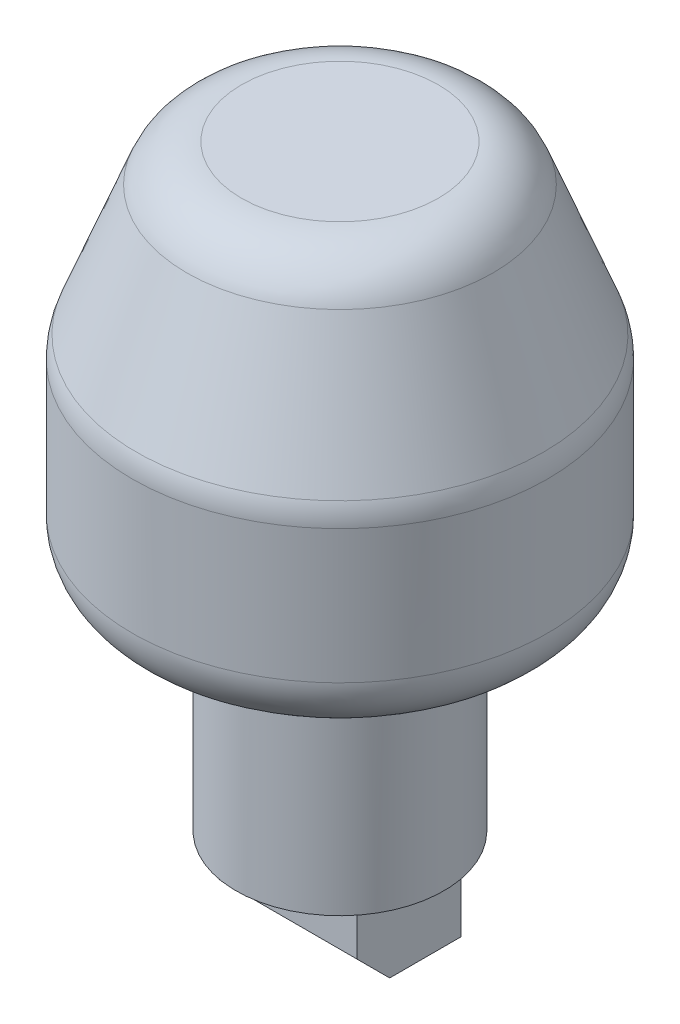
ISO-10303-21;
HEADER;
FILE_DESCRIPTION(('STEP AP214'),'2;1');
FILE_NAME('part.step','',(''),(''),'','','');
FILE_SCHEMA(('AUTOMOTIVE_DESIGN { 1 0 10303 214 1 1 1 1 }'));
ENDSEC;
DATA;
#1=APPLICATION_CONTEXT('core data for automotive mechanical design processes');
#2=APPLICATION_PROTOCOL_DEFINITION('international standard','automotive_design',2000,#1);
#3=PRODUCT_CONTEXT('',#1,'mechanical');
#4=PRODUCT('Part','Part','',(#3));
#5=PRODUCT_RELATED_PRODUCT_CATEGORY('part','',(#4));
#6=PRODUCT_DEFINITION_FORMATION('','',#4);
#7=PRODUCT_DEFINITION_CONTEXT('part definition',#1,'design');
#8=PRODUCT_DEFINITION('design','',#6,#7);
#9=PRODUCT_DEFINITION_SHAPE('','',#8);
#10=(LENGTH_UNIT() NAMED_UNIT(*) SI_UNIT(.MILLI.,.METRE.));
#11=(NAMED_UNIT(*) PLANE_ANGLE_UNIT() SI_UNIT($,.RADIAN.));
#12=(NAMED_UNIT(*) SI_UNIT($,.STERADIAN.) SOLID_ANGLE_UNIT());
#13=UNCERTAINTY_MEASURE_WITH_UNIT(LENGTH_MEASURE(1.E-05),#10,'distance_accuracy_value','');
#14=(GEOMETRIC_REPRESENTATION_CONTEXT(3) GLOBAL_UNCERTAINTY_ASSIGNED_CONTEXT((#13)) GLOBAL_UNIT_ASSIGNED_CONTEXT((#10,
#11,#12)) REPRESENTATION_CONTEXT('',''));
#15=CARTESIAN_POINT('',(0.,0.,0.));
#16=DIRECTION('',(0.,0.,1.));
#17=DIRECTION('',(1.,0.,0.));
#18=AXIS2_PLACEMENT_3D('',#15,#16,#17);
#19=CARTESIAN_POINT('',(7.4549,-9.01718142394338,0.));
#20=DIRECTION('',(0.,-1.,0.));
#21=DIRECTION('',(0.,0.,-1.));
#22=AXIS2_PLACEMENT_3D('',#19,#20,#21);
#23=PLANE('',#22);
#24=DIRECTION('',(0.,0.,1.));
#25=VECTOR('',#24,1.);
#26=CARTESIAN_POINT('',(7.3279,-9.01718142394338,0.));
#27=LINE('',#26,#25);
#28=CARTESIAN_POINT('',(7.3279,-9.01718142394338,-5.49919071197169));
#29=VERTEX_POINT('',#28);
#30=CARTESIAN_POINT('',(7.3279,-9.01718142394338,1.9430092880283));
#31=VERTEX_POINT('',#30);
#32=EDGE_CURVE('E61',#29,#31,#27,.T.);
#33=ORIENTED_EDGE('',*,*,#32,.F.);
#34=DIRECTION('',(1.,0.,0.));
#35=VECTOR('',#34,1.);
#36=CARTESIAN_POINT('',(0.,-9.01718142394338,-5.49919071197169));
#37=LINE('',#36,#35);
#38=CARTESIAN_POINT('',(2.54762,-9.01718142394338,-5.49919071197169));
#39=VERTEX_POINT('',#38);
#40=EDGE_CURVE('E212',#39,#29,#37,.T.);
#41=ORIENTED_EDGE('',*,*,#40,.F.);
#42=DIRECTION('',(0.,0.,-1.));
#43=VECTOR('',#42,1.);
#44=CARTESIAN_POINT('',(2.54762,-9.01718142394338,0.));
#45=LINE('',#44,#43);
#46=CARTESIAN_POINT('',(2.54762,-9.01718142394338,1.94300928802831));
#47=VERTEX_POINT('',#46);
#48=EDGE_CURVE('E227',#47,#39,#45,.T.);
#49=ORIENTED_EDGE('',*,*,#48,.F.);
#50=DIRECTION('',(-1.,0.,0.));
#51=VECTOR('',#50,1.);
#52=CARTESIAN_POINT('',(0.,-9.01718142394338,1.9430092880283));
#53=LINE('',#52,#51);
#54=EDGE_CURVE('E223',#31,#47,#53,.T.);
#55=ORIENTED_EDGE('',*,*,#54,.F.);
#56=EDGE_LOOP('',(#33,#41,#49,#55));
#57=FACE_BOUND('',#56,.T.);
#58=DIRECTION('',(-1.,0.,0.));
#59=VECTOR('',#58,1.);
#60=CARTESIAN_POINT('',(0.,-9.01718142394338,1.9430092880283));
#61=LINE('',#60,#59);
#62=CARTESIAN_POINT('',(-2.54762,-9.01718142394338,1.9430092880283));
#63=VERTEX_POINT('',#62);
#64=CARTESIAN_POINT('',(-7.3279,-9.01718142394338,1.9430092880283));
#65=VERTEX_POINT('',#64);
#66=EDGE_CURVE('E287',#63,#65,#61,.T.);
#67=ORIENTED_EDGE('',*,*,#66,.F.);
#68=DIRECTION('',(0.,0.,-1.));
#69=VECTOR('',#68,1.);
#70=CARTESIAN_POINT('',(-2.54762,-9.01718142394338,0.));
#71=LINE('',#70,#69);
#72=CARTESIAN_POINT('',(-2.54762,-9.01718142394338,-5.49919071197169));
#73=VERTEX_POINT('',#72);
#74=EDGE_CURVE('E265',#63,#73,#71,.T.);
#75=ORIENTED_EDGE('',*,*,#74,.T.);
#76=DIRECTION('',(1.,0.,0.));
#77=VECTOR('',#76,1.);
#78=CARTESIAN_POINT('',(0.,-9.01718142394338,-5.49919071197169));
#79=LINE('',#78,#77);
#80=CARTESIAN_POINT('',(-7.3279,-9.01718142394338,-5.49919071197169));
#81=VERTEX_POINT('',#80);
#82=EDGE_CURVE('E275',#81,#73,#79,.T.);
#83=ORIENTED_EDGE('',*,*,#82,.F.);
#84=DIRECTION('',(0.,0.,-1.));
#85=VECTOR('',#84,1.);
#86=CARTESIAN_POINT('',(-7.3279,-9.01718142394338,0.));
#87=LINE('',#86,#85);
#88=EDGE_CURVE('E290',#65,#81,#87,.T.);
#89=ORIENTED_EDGE('',*,*,#88,.F.);
#90=EDGE_LOOP('',(#67,#75,#83,#89));
#91=FACE_BOUND('',#90,.T.);
#92=DIRECTION('',(0.,0.,1.));
#93=VECTOR('',#92,1.);
#94=CARTESIAN_POINT('',(-7.4549,-9.01718142394338,0.));
#95=LINE('',#94,#93);
#96=CARTESIAN_POINT('',(-7.4549,-9.01718142394338,-5.6261907119717));
#97=VERTEX_POINT('',#96);
#98=CARTESIAN_POINT('',(-7.4549,-9.01718142394338,2.0700092880283));
#99=VERTEX_POINT('',#98);
#100=EDGE_CURVE('E325',#97,#99,#95,.T.);
#101=ORIENTED_EDGE('',*,*,#100,.F.);
#102=DIRECTION('',(-1.,0.,0.));
#103=VECTOR('',#102,1.);
#104=CARTESIAN_POINT('',(7.4549,-9.01718142394338,-5.6261907119717));
#105=LINE('',#104,#103);
#106=CARTESIAN_POINT('',(7.4549,-9.01718142394338,-5.6261907119717));
#107=VERTEX_POINT('',#106);
#108=EDGE_CURVE('E331',#107,#97,#105,.T.);
#109=ORIENTED_EDGE('',*,*,#108,.F.);
#110=DIRECTION('',(0.,0.,1.));
#111=VECTOR('',#110,1.);
#112=CARTESIAN_POINT('',(7.4549,-9.01718142394338,0.));
#113=LINE('',#112,#111);
#114=CARTESIAN_POINT('',(7.4549,-9.01718142394338,2.0700092880283));
#115=VERTEX_POINT('',#114);
#116=EDGE_CURVE('E311',#107,#115,#113,.T.);
#117=ORIENTED_EDGE('',*,*,#116,.T.);
#118=DIRECTION('',(-1.,0.,0.));
#119=VECTOR('',#118,1.);
#120=CARTESIAN_POINT('',(7.4549,-9.01718142394338,2.0700092880283));
#121=LINE('',#120,#119);
#122=EDGE_CURVE('E333',#115,#99,#121,.T.);
#123=ORIENTED_EDGE('',*,*,#122,.T.);
#124=EDGE_LOOP('',(#101,#109,#117,#123));
#125=FACE_BOUND('',#124,.T.);
#126=DIRECTION('',(-1.,0.,0.));
#127=VECTOR('',#126,1.);
#128=CARTESIAN_POINT('',(0.,-9.01718142394338,1.9430092880283));
#129=LINE('',#128,#127);
#130=CARTESIAN_POINT('',(2.42062,-9.01718142394338,1.9430092880283));
#131=VERTEX_POINT('',#130);
#132=CARTESIAN_POINT('',(-2.42062,-9.01718142394338,1.94300928802831));
#133=VERTEX_POINT('',#132);
#134=EDGE_CURVE('E255',#131,#133,#129,.T.);
#135=ORIENTED_EDGE('',*,*,#134,.F.);
#136=DIRECTION('',(0.,0.,-1.));
#137=VECTOR('',#136,1.);
#138=CARTESIAN_POINT('',(2.42062,-9.01718142394338,0.));
#139=LINE('',#138,#137);
#140=CARTESIAN_POINT('',(2.42062,-9.01718142394338,-5.49919071197169));
#141=VERTEX_POINT('',#140);
#142=EDGE_CURVE('E234',#131,#141,#139,.T.);
#143=ORIENTED_EDGE('',*,*,#142,.T.);
#144=DIRECTION('',(1.,0.,0.));
#145=VECTOR('',#144,1.);
#146=CARTESIAN_POINT('',(0.,-9.01718142394338,-5.49919071197169));
#147=LINE('',#146,#145);
#148=CARTESIAN_POINT('',(-2.42062,-9.01718142394338,-5.49919071197169));
#149=VERTEX_POINT('',#148);
#150=EDGE_CURVE('E243',#149,#141,#147,.T.);
#151=ORIENTED_EDGE('',*,*,#150,.F.);
#152=DIRECTION('',(0.,0.,-1.));
#153=VECTOR('',#152,1.);
#154=CARTESIAN_POINT('',(-2.42062,-9.01718142394338,0.));
#155=LINE('',#154,#153);
#156=EDGE_CURVE('E258',#133,#149,#155,.T.);
#157=ORIENTED_EDGE('',*,*,#156,.F.);
#158=EDGE_LOOP('',(#135,#143,#151,#157));
#159=FACE_BOUND('',#158,.T.);
#160=ADVANCED_FACE('F38',(#57,#91,#125,#159),#23,.T.);
#161=CARTESIAN_POINT('',(0.,0.,0.));
#162=DIRECTION('',(0.,1.,0.));
#163=DIRECTION('',(-1.,0.,0.));
#164=AXIS2_PLACEMENT_3D('',#161,#162,#163);
#165=PLANE('',#164);
#166=DIRECTION('',(-1.,0.,0.));
#167=VECTOR('',#166,1.);
#168=CARTESIAN_POINT('',(7.4549,0.,5.62619071197169));
#169=LINE('',#168,#167);
#170=CARTESIAN_POINT('',(7.4549,0.,5.62619071197169));
#171=VERTEX_POINT('',#170);
#172=CARTESIAN_POINT('',(-7.4549,0.,5.62619071197169));
#173=VERTEX_POINT('',#172);
#174=EDGE_CURVE('E338',#171,#173,#169,.T.);
#175=ORIENTED_EDGE('',*,*,#174,.F.);
#176=DIRECTION('',(0.,0.,-1.));
#177=VECTOR('',#176,1.);
#178=CARTESIAN_POINT('',(7.4549,0.,0.));
#179=LINE('',#178,#177);
#180=CARTESIAN_POINT('',(7.4549,0.,-5.62619071197169));
#181=VERTEX_POINT('',#180);
#182=EDGE_CURVE('E304',#171,#181,#179,.T.);
#183=ORIENTED_EDGE('',*,*,#182,.T.);
#184=DIRECTION('',(-1.,0.,0.));
#185=VECTOR('',#184,1.);
#186=CARTESIAN_POINT('',(7.4549,0.,-5.62619071197169));
#187=LINE('',#186,#185);
#188=CARTESIAN_POINT('',(-7.4549,0.,-5.62619071197169));
#189=VERTEX_POINT('',#188);
#190=EDGE_CURVE('E317',#181,#189,#187,.T.);
#191=ORIENTED_EDGE('',*,*,#190,.T.);
#192=DIRECTION('',(0.,0.,-1.));
#193=VECTOR('',#192,1.);
#194=CARTESIAN_POINT('',(-7.4549,0.,0.));
#195=LINE('',#194,#193);
#196=EDGE_CURVE('E297',#173,#189,#195,.T.);
#197=ORIENTED_EDGE('',*,*,#196,.F.);
#198=EDGE_LOOP('',(#175,#183,#191,#197));
#199=FACE_BOUND('',#198,.T.);
#200=CARTESIAN_POINT('',(0.,0.,0.));
#201=DIRECTION('',(0.,1.,0.));
#202=DIRECTION('',(-1.,0.,0.));
#203=AXIS2_PLACEMENT_3D('',#200,#201,#202);
#204=CIRCLE('',#203,11.2395);
#205=CARTESIAN_POINT('',(-11.2395,0.,0.));
#206=VERTEX_POINT('',#205);
#207=EDGE_CURVE('E343',#206,#206,#204,.T.);
#208=ORIENTED_EDGE('',*,*,#207,.F.);
#209=EDGE_LOOP('',(#208));
#210=FACE_BOUND('',#209,.T.);
#211=ADVANCED_FACE('F378',(#199,#210),#165,.F.);
#212=CARTESIAN_POINT('',(0.,64.6193127521161,0.));
#213=DIRECTION('',(0.,1.,0.));
#214=DIRECTION('',(-1.,0.,0.));
#215=AXIS2_PLACEMENT_3D('',#212,#213,#214);
#216=CYLINDRICAL_SURFACE('',#215,11.2395);
#217=CARTESIAN_POINT('',(0.,21.2344,0.));
#218=DIRECTION('',(0.,-1.,0.));
#219=DIRECTION('',(0.,0.,-1.));
#220=AXIS2_PLACEMENT_3D('',#217,#218,#219);
#221=CIRCLE('',#220,11.2395);
#222=CARTESIAN_POINT('',(-1.778,21.2344,11.0979762231679));
#223=VERTEX_POINT('',#222);
#224=CARTESIAN_POINT('',(1.778,21.2344,11.0979762231679));
#225=VERTEX_POINT('',#224);
#226=EDGE_CURVE('E185',#223,#225,#221,.F.);
#227=ORIENTED_EDGE('',*,*,#226,.F.);
#228=DIRECTION('',(0.,1.,0.));
#229=VECTOR('',#228,1.);
#230=CARTESIAN_POINT('',(-1.778,64.6193127521161,11.0979762231679));
#231=LINE('',#230,#229);
#232=CARTESIAN_POINT('',(-1.778,23.4188,11.0979762231679));
#233=VERTEX_POINT('',#232);
#234=EDGE_CURVE('E190',#233,#223,#231,.F.);
#235=ORIENTED_EDGE('',*,*,#234,.F.);
#236=CARTESIAN_POINT('',(0.,23.4188,0.));
#237=DIRECTION('',(0.,1.,0.));
#238=DIRECTION('',(-1.,0.,0.));
#239=AXIS2_PLACEMENT_3D('',#236,#237,#238);
#240=CIRCLE('',#239,11.2395);
#241=CARTESIAN_POINT('',(1.778,23.4188,11.0979762231679));
#242=VERTEX_POINT('',#241);
#243=EDGE_CURVE('E341',#242,#233,#240,.T.);
#244=ORIENTED_EDGE('',*,*,#243,.F.);
#245=DIRECTION('',(0.,1.,0.));
#246=VECTOR('',#245,1.);
#247=CARTESIAN_POINT('',(1.778,64.6193127521161,11.0979762231679));
#248=LINE('',#247,#246);
#249=EDGE_CURVE('E53',#225,#242,#248,.T.);
#250=ORIENTED_EDGE('',*,*,#249,.F.);
#251=EDGE_LOOP('',(#227,#235,#244,#250));
#252=FACE_BOUND('',#251,.T.);
#253=ORIENTED_EDGE('',*,*,#207,.T.);
#254=EDGE_LOOP('',(#253));
#255=FACE_BOUND('',#254,.T.);
#256=ADVANCED_FACE('F200',(#252,#255),#216,.T.);
#257=CARTESIAN_POINT('',(11.2395,23.4188,0.));
#258=DIRECTION('',(0.,1.,0.));
#259=DIRECTION('',(-1.,0.,0.));
#260=AXIS2_PLACEMENT_3D('',#257,#258,#259);
#261=PLANE('',#260);
#262=CARTESIAN_POINT('',(0.,23.4188,0.));
#263=DIRECTION('',(0.,1.,0.));
#264=DIRECTION('',(-1.,0.,0.));
#265=AXIS2_PLACEMENT_3D('',#262,#263,#264);
#266=CIRCLE('',#265,16.123370687632);
#267=CARTESIAN_POINT('',(-16.123370687632,23.4188,0.));
#268=VERTEX_POINT('',#267);
#269=EDGE_CURVE('E352',#268,#268,#266,.F.);
#270=ORIENTED_EDGE('',*,*,#269,.T.);
#271=EDGE_LOOP('',(#270));
#272=FACE_BOUND('',#271,.T.);
#273=ORIENTED_EDGE('',*,*,#243,.T.);
#274=DIRECTION('',(0.,0.,1.));
#275=VECTOR('',#274,1.);
#276=CARTESIAN_POINT('',(-1.778,23.4188,-22.474370687632));
#277=LINE('',#276,#275);
#278=CARTESIAN_POINT('',(-1.778,23.4188,14.29512));
#279=VERTEX_POINT('',#278);
#280=EDGE_CURVE('E195',#233,#279,#277,.T.);
#281=ORIENTED_EDGE('',*,*,#280,.T.);
#282=DIRECTION('',(-1.,0.,0.));
#283=VECTOR('',#282,1.);
#284=CARTESIAN_POINT('',(-1.778,23.4188,14.29512));
#285=LINE('',#284,#283);
#286=CARTESIAN_POINT('',(1.778,23.4188,14.29512));
#287=VERTEX_POINT('',#286);
#288=EDGE_CURVE('E708',#287,#279,#285,.T.);
#289=ORIENTED_EDGE('',*,*,#288,.F.);
#290=DIRECTION('',(0.,0.,1.));
#291=VECTOR('',#290,1.);
#292=CARTESIAN_POINT('',(1.778,23.4188,-22.474370687632));
#293=LINE('',#292,#291);
#294=EDGE_CURVE('E224',#242,#287,#293,.T.);
#295=ORIENTED_EDGE('',*,*,#294,.F.);
#296=EDGE_LOOP('',(#273,#281,#289,#295));
#297=FACE_BOUND('',#296,.T.);
#298=ADVANCED_FACE('F406',(#272,#297),#261,.F.);
#299=CARTESIAN_POINT('',(0.,64.6193127521161,0.));
#300=DIRECTION('',(0.,1.,0.));
#301=DIRECTION('',(-1.,0.,0.));
#302=AXIS2_PLACEMENT_3D('',#299,#300,#301);
#303=CYLINDRICAL_SURFACE('',#302,22.473370687632);
#304=CARTESIAN_POINT('',(0.,29.7688,0.));
#305=DIRECTION('',(0.,1.,0.));
#306=DIRECTION('',(-1.,0.,0.));
#307=AXIS2_PLACEMENT_3D('',#304,#305,#306);
#308=CIRCLE('',#307,22.473370687632);
#309=CARTESIAN_POINT('',(-22.473370687632,29.7688,0.));
#310=VERTEX_POINT('',#309);
#311=EDGE_CURVE('E349',#310,#310,#308,.T.);
#312=ORIENTED_EDGE('',*,*,#311,.T.);
#313=EDGE_LOOP('',(#312));
#314=FACE_BOUND('',#313,.T.);
#315=CARTESIAN_POINT('',(0.,44.2210933640308,0.));
#316=DIRECTION('',(0.,-1.,0.));
#317=DIRECTION('',(1.,0.,0.));
#318=AXIS2_PLACEMENT_3D('',#315,#316,#317);
#319=CIRCLE('',#318,22.473370687632);
#320=CARTESIAN_POINT('',(22.473370687632,44.2210933640308,0.));
#321=VERTEX_POINT('',#320);
#322=EDGE_CURVE('E346',#321,#321,#319,.T.);
#323=ORIENTED_EDGE('',*,*,#322,.T.);
#324=EDGE_LOOP('',(#323));
#325=FACE_BOUND('',#324,.T.);
#326=ADVANCED_FACE('F403',(#314,#325),#303,.T.);
#327=CARTESIAN_POINT('',(0.,45.4152,0.));
#328=DIRECTION('',(0.,-1.,0.));
#329=DIRECTION('',(1.,0.,0.));
#330=AXIS2_PLACEMENT_3D('',#327,#328,#329);
#331=CONICAL_SURFACE('',#330,22.473370687632,0.371755130674789);
#332=CARTESIAN_POINT('',(0.,46.5277386775342,0.));
#333=DIRECTION('',(0.,1.,0.));
#334=DIRECTION('',(-1.,0.,0.));
#335=AXIS2_PLACEMENT_3D('',#332,#333,#334);
#336=CIRCLE('',#335,22.0396099828003);
#337=CARTESIAN_POINT('',(-22.0396099828003,46.5277386775342,0.));
#338=VERTEX_POINT('',#337);
#339=EDGE_CURVE('E46',#338,#338,#336,.T.);
#340=ORIENTED_EDGE('',*,*,#339,.T.);
#341=EDGE_LOOP('',(#340));
#342=FACE_BOUND('',#341,.T.);
#343=CARTESIAN_POINT('',(0.,60.5759580656195,0.));
#344=DIRECTION('',(0.,1.,0.));
#345=DIRECTION('',(-1.,0.,0.));
#346=AXIS2_PLACEMENT_3D('',#343,#344,#345);
#347=CIRCLE('',#346,16.5624381177172);
#348=CARTESIAN_POINT('',(-16.5624381177172,60.5759580656195,0.));
#349=VERTEX_POINT('',#348);
#350=EDGE_CURVE('E355',#349,#349,#347,.F.);
#351=ORIENTED_EDGE('',*,*,#350,.T.);
#352=EDGE_LOOP('',(#351));
#353=FACE_BOUND('',#352,.T.);
#354=ADVANCED_FACE('F360',(#342,#353),#331,.T.);
#355=CARTESIAN_POINT('',(14.986,64.6193127521161,0.));
#356=DIRECTION('',(0.,-1.,0.));
#357=DIRECTION('',(1.,0.,0.));
#358=AXIS2_PLACEMENT_3D('',#355,#356,#357);
#359=PLANE('',#358);
#360=CARTESIAN_POINT('',(0.,64.6193127521161,0.));
#361=DIRECTION('',(0.,-1.,0.));
#362=DIRECTION('',(1.,0.,0.));
#363=AXIS2_PLACEMENT_3D('',#360,#361,#362);
#364=CIRCLE('',#363,10.6461988225489);
#365=CARTESIAN_POINT('',(10.6461988225489,64.6193127521161,0.));
#366=VERTEX_POINT('',#365);
#367=EDGE_CURVE('E11',#366,#366,#364,.F.);
#368=ORIENTED_EDGE('',*,*,#367,.T.);
#369=EDGE_LOOP('',(#368));
#370=FACE_BOUND('',#369,.T.);
#371=ADVANCED_FACE('F373',(#370),#359,.F.);
#372=CARTESIAN_POINT('',(0.,29.7688,0.));
#373=DIRECTION('',(0.,1.,0.));
#374=DIRECTION('',(-1.,0.,0.));
#375=AXIS2_PLACEMENT_3D('',#372,#373,#374);
#376=TOROIDAL_SURFACE('',#375,16.123370687632,6.35);
#377=ORIENTED_EDGE('',*,*,#269,.F.);
#378=EDGE_LOOP('',(#377));
#379=FACE_BOUND('',#378,.T.);
#380=ORIENTED_EDGE('',*,*,#311,.F.);
#381=EDGE_LOOP('',(#380));
#382=FACE_BOUND('',#381,.T.);
#383=ADVANCED_FACE('F365',(#379,#382),#376,.T.);
#384=CARTESIAN_POINT('',(0.,44.2210933640308,0.));
#385=DIRECTION('',(0.,-1.,0.));
#386=DIRECTION('',(1.,0.,0.));
#387=AXIS2_PLACEMENT_3D('',#384,#385,#386);
#388=TOROIDAL_SURFACE('',#387,16.123370687632,6.35);
#389=ORIENTED_EDGE('',*,*,#322,.F.);
#390=EDGE_LOOP('',(#389));
#391=FACE_BOUND('',#390,.T.);
#392=ORIENTED_EDGE('',*,*,#339,.F.);
#393=EDGE_LOOP('',(#392));
#394=FACE_BOUND('',#393,.T.);
#395=ADVANCED_FACE('F363',(#391,#394),#388,.T.);
#396=CARTESIAN_POINT('',(0.,58.2693127521161,0.));
#397=DIRECTION('',(0.,-1.,0.));
#398=DIRECTION('',(1.,0.,0.));
#399=AXIS2_PLACEMENT_3D('',#396,#397,#398);
#400=TOROIDAL_SURFACE('',#399,10.6461988225489,6.35);
#401=ORIENTED_EDGE('',*,*,#350,.F.);
#402=EDGE_LOOP('',(#401));
#403=FACE_BOUND('',#402,.T.);
#404=ORIENTED_EDGE('',*,*,#367,.F.);
#405=EDGE_LOOP('',(#404));
#406=FACE_BOUND('',#405,.T.);
#407=ADVANCED_FACE('F40',(#403,#406),#400,.T.);
#408=CARTESIAN_POINT('',(7.4549,0.,5.62619071197169));
#409=DIRECTION('',(0.,0.,-1.));
#410=DIRECTION('',(0.,1.,0.));
#411=AXIS2_PLACEMENT_3D('',#408,#409,#410);
#412=PLANE('',#411);
#413=DIRECTION('',(0.,-1.,0.));
#414=VECTOR('',#413,1.);
#415=CARTESIAN_POINT('',(-7.4549,0.,5.62619071197169));
#416=LINE('',#415,#414);
#417=CARTESIAN_POINT('',(-7.4549,-5.461,5.62619071197169));
#418=VERTEX_POINT('',#417);
#419=EDGE_CURVE('E320',#173,#418,#416,.T.);
#420=ORIENTED_EDGE('',*,*,#419,.T.);
#421=DIRECTION('',(-1.,0.,0.));
#422=VECTOR('',#421,1.);
#423=CARTESIAN_POINT('',(7.4549,-5.461,5.62619071197169));
#424=LINE('',#423,#422);
#425=CARTESIAN_POINT('',(7.4549,-5.461,5.62619071197169));
#426=VERTEX_POINT('',#425);
#427=EDGE_CURVE('E335',#426,#418,#424,.T.);
#428=ORIENTED_EDGE('',*,*,#427,.F.);
#429=DIRECTION('',(0.,-1.,0.));
#430=VECTOR('',#429,1.);
#431=CARTESIAN_POINT('',(7.4549,0.,5.62619071197169));
#432=LINE('',#431,#430);
#433=EDGE_CURVE('E306',#171,#426,#432,.T.);
#434=ORIENTED_EDGE('',*,*,#433,.F.);
#435=ORIENTED_EDGE('',*,*,#174,.T.);
#436=EDGE_LOOP('',(#420,#428,#434,#435));
#437=FACE_BOUND('',#436,.T.);
#438=ADVANCED_FACE('F371',(#437),#412,.F.);
#439=CARTESIAN_POINT('',(7.4549,-5.54359535598586,5.54359535598584));
#440=DIRECTION('',(0.,0.707106781186549,-0.707106781186546));
#441=DIRECTION('',(0.,0.707106781186546,0.707106781186549));
#442=AXIS2_PLACEMENT_3D('',#439,#440,#441);
#443=PLANE('',#442);
#444=DIRECTION('',(0.,-0.707106781186546,-0.707106781186549));
#445=VECTOR('',#444,1.);
#446=CARTESIAN_POINT('',(-7.4549,-5.54359535598586,5.54359535598584));
#447=LINE('',#446,#445);
#448=EDGE_CURVE('E322',#418,#99,#447,.T.);
#449=ORIENTED_EDGE('',*,*,#448,.T.);
#450=ORIENTED_EDGE('',*,*,#122,.F.);
#451=DIRECTION('',(0.,-0.707106781186546,-0.707106781186549));
#452=VECTOR('',#451,1.);
#453=CARTESIAN_POINT('',(7.4549,-5.54359535598586,5.54359535598584));
#454=LINE('',#453,#452);
#455=EDGE_CURVE('E309',#426,#115,#454,.T.);
#456=ORIENTED_EDGE('',*,*,#455,.F.);
#457=ORIENTED_EDGE('',*,*,#427,.T.);
#458=EDGE_LOOP('',(#449,#450,#456,#457));
#459=FACE_BOUND('',#458,.T.);
#460=ADVANCED_FACE('F391',(#459),#443,.F.);
#461=CARTESIAN_POINT('',(7.4549,0.,-5.62619071197169));
#462=DIRECTION('',(0.,0.,-1.));
#463=DIRECTION('',(0.,1.,0.));
#464=AXIS2_PLACEMENT_3D('',#461,#462,#463);
#465=PLANE('',#464);
#466=DIRECTION('',(0.,-1.,0.));
#467=VECTOR('',#466,1.);
#468=CARTESIAN_POINT('',(-7.4549,0.,-5.62619071197169));
#469=LINE('',#468,#467);
#470=EDGE_CURVE('E307',#189,#97,#469,.T.);
#471=ORIENTED_EDGE('',*,*,#470,.F.);
#472=ORIENTED_EDGE('',*,*,#190,.F.);
#473=DIRECTION('',(0.,-1.,0.));
#474=VECTOR('',#473,1.);
#475=CARTESIAN_POINT('',(7.4549,0.,-5.62619071197169));
#476=LINE('',#475,#474);
#477=EDGE_CURVE('E314',#181,#107,#476,.T.);
#478=ORIENTED_EDGE('',*,*,#477,.T.);
#479=ORIENTED_EDGE('',*,*,#108,.T.);
#480=EDGE_LOOP('',(#471,#472,#478,#479));
#481=FACE_BOUND('',#480,.T.);
#482=ADVANCED_FACE('F389',(#481),#465,.T.);
#483=CARTESIAN_POINT('',(7.4549,0.,0.));
#484=DIRECTION('',(1.,0.,0.));
#485=DIRECTION('',(0.,0.,-1.));
#486=AXIS2_PLACEMENT_3D('',#483,#484,#485);
#487=PLANE('',#486);
#488=ORIENTED_EDGE('',*,*,#182,.F.);
#489=ORIENTED_EDGE('',*,*,#433,.T.);
#490=ORIENTED_EDGE('',*,*,#455,.T.);
#491=ORIENTED_EDGE('',*,*,#116,.F.);
#492=ORIENTED_EDGE('',*,*,#477,.F.);
#493=EDGE_LOOP('',(#488,#489,#490,#491,#492));
#494=FACE_BOUND('',#493,.T.);
#495=ADVANCED_FACE('F479',(#494),#487,.T.);
#496=CARTESIAN_POINT('',(-7.4549,0.,0.));
#497=DIRECTION('',(1.,0.,0.));
#498=DIRECTION('',(0.,0.,-1.));
#499=AXIS2_PLACEMENT_3D('',#496,#497,#498);
#500=PLANE('',#499);
#501=ORIENTED_EDGE('',*,*,#196,.T.);
#502=ORIENTED_EDGE('',*,*,#470,.T.);
#503=ORIENTED_EDGE('',*,*,#100,.T.);
#504=ORIENTED_EDGE('',*,*,#448,.F.);
#505=ORIENTED_EDGE('',*,*,#419,.F.);
#506=EDGE_LOOP('',(#501,#502,#503,#504,#505));
#507=FACE_BOUND('',#506,.T.);
#508=ADVANCED_FACE('F488',(#507),#500,.F.);
#509=CARTESIAN_POINT('',(-2.54762,-6.47718142394338,0.));
#510=DIRECTION('',(-1.,0.,0.));
#511=DIRECTION('',(0.,0.,1.));
#512=AXIS2_PLACEMENT_3D('',#509,#510,#511);
#513=PLANE('',#512);
#514=ORIENTED_EDGE('',*,*,#74,.F.);
#515=DIRECTION('',(0.,-1.,0.));
#516=VECTOR('',#515,1.);
#517=CARTESIAN_POINT('',(-2.54762,-6.47718142394338,1.94300928802831));
#518=LINE('',#517,#516);
#519=CARTESIAN_POINT('',(-2.54762,-6.47718142394338,1.94300928802831));
#520=VERTEX_POINT('',#519);
#521=EDGE_CURVE('E284',#520,#63,#518,.T.);
#522=ORIENTED_EDGE('',*,*,#521,.F.);
#523=DIRECTION('',(0.,0.,-1.));
#524=VECTOR('',#523,1.);
#525=CARTESIAN_POINT('',(-2.54762,-6.47718142394338,0.));
#526=LINE('',#525,#524);
#527=CARTESIAN_POINT('',(-2.54762,-6.47718142394338,-5.49919071197169));
#528=VERTEX_POINT('',#527);
#529=EDGE_CURVE('E272',#520,#528,#526,.T.);
#530=ORIENTED_EDGE('',*,*,#529,.T.);
#531=DIRECTION('',(0.,-1.,0.));
#532=VECTOR('',#531,1.);
#533=CARTESIAN_POINT('',(-2.54762,-6.47718142394338,-5.49919071197169));
#534=LINE('',#533,#532);
#535=EDGE_CURVE('E295',#528,#73,#534,.T.);
#536=ORIENTED_EDGE('',*,*,#535,.T.);
#537=EDGE_LOOP('',(#514,#522,#530,#536));
#538=FACE_BOUND('',#537,.T.);
#539=ADVANCED_FACE('F497',(#538),#513,.T.);
#540=CARTESIAN_POINT('',(0.,-6.47718142394338,-5.49919071197169));
#541=DIRECTION('',(0.,0.,-1.));
#542=DIRECTION('',(0.,1.,0.));
#543=AXIS2_PLACEMENT_3D('',#540,#541,#542);
#544=PLANE('',#543);
#545=ORIENTED_EDGE('',*,*,#82,.T.);
#546=ORIENTED_EDGE('',*,*,#535,.F.);
#547=DIRECTION('',(1.,0.,0.));
#548=VECTOR('',#547,1.);
#549=CARTESIAN_POINT('',(0.,-6.47718142394338,-5.49919071197169));
#550=LINE('',#549,#548);
#551=CARTESIAN_POINT('',(-7.3279,-6.47718142394338,-5.49919071197169));
#552=VERTEX_POINT('',#551);
#553=EDGE_CURVE('E281',#552,#528,#550,.T.);
#554=ORIENTED_EDGE('',*,*,#553,.F.);
#555=DIRECTION('',(0.,-1.,0.));
#556=VECTOR('',#555,1.);
#557=CARTESIAN_POINT('',(-7.3279,-6.47718142394338,-5.49919071197169));
#558=LINE('',#557,#556);
#559=EDGE_CURVE('E298',#552,#81,#558,.T.);
#560=ORIENTED_EDGE('',*,*,#559,.T.);
#561=EDGE_LOOP('',(#545,#546,#554,#560));
#562=FACE_BOUND('',#561,.T.);
#563=ADVANCED_FACE('F512',(#562),#544,.F.);
#564=CARTESIAN_POINT('',(-7.3279,-6.47718142394338,0.));
#565=DIRECTION('',(-1.,0.,0.));
#566=DIRECTION('',(0.,0.,1.));
#567=AXIS2_PLACEMENT_3D('',#564,#565,#566);
#568=PLANE('',#567);
#569=ORIENTED_EDGE('',*,*,#88,.T.);
#570=ORIENTED_EDGE('',*,*,#559,.F.);
#571=DIRECTION('',(0.,0.,-1.));
#572=VECTOR('',#571,1.);
#573=CARTESIAN_POINT('',(-7.3279,-6.47718142394338,0.));
#574=LINE('',#573,#572);
#575=CARTESIAN_POINT('',(-7.3279,-6.47718142394338,1.94300928802831));
#576=VERTEX_POINT('',#575);
#577=EDGE_CURVE('E278',#576,#552,#574,.T.);
#578=ORIENTED_EDGE('',*,*,#577,.F.);
#579=DIRECTION('',(0.,-1.,0.));
#580=VECTOR('',#579,1.);
#581=CARTESIAN_POINT('',(-7.3279,-6.47718142394338,1.94300928802831));
#582=LINE('',#581,#580);
#583=EDGE_CURVE('E300',#576,#65,#582,.T.);
#584=ORIENTED_EDGE('',*,*,#583,.T.);
#585=EDGE_LOOP('',(#569,#570,#578,#584));
#586=FACE_BOUND('',#585,.T.);
#587=ADVANCED_FACE('F524',(#586),#568,.F.);
#588=CARTESIAN_POINT('',(0.,-6.47718142394338,1.94300928802831));
#589=DIRECTION('',(0.,0.,1.));
#590=DIRECTION('',(0.,-1.,0.));
#591=AXIS2_PLACEMENT_3D('',#588,#589,#590);
#592=PLANE('',#591);
#593=ORIENTED_EDGE('',*,*,#66,.T.);
#594=ORIENTED_EDGE('',*,*,#583,.F.);
#595=DIRECTION('',(-1.,0.,0.));
#596=VECTOR('',#595,1.);
#597=CARTESIAN_POINT('',(0.,-6.47718142394338,1.94300928802831));
#598=LINE('',#597,#596);
#599=EDGE_CURVE('E274',#520,#576,#598,.T.);
#600=ORIENTED_EDGE('',*,*,#599,.F.);
#601=ORIENTED_EDGE('',*,*,#521,.T.);
#602=EDGE_LOOP('',(#593,#594,#600,#601));
#603=FACE_BOUND('',#602,.T.);
#604=ADVANCED_FACE('F537',(#603),#592,.F.);
#605=CARTESIAN_POINT('',(0.,-6.47718142394338,0.));
#606=DIRECTION('',(0.,-1.,0.));
#607=DIRECTION('',(0.,0.,-1.));
#608=AXIS2_PLACEMENT_3D('',#605,#606,#607);
#609=PLANE('',#608);
#610=ORIENTED_EDGE('',*,*,#529,.F.);
#611=ORIENTED_EDGE('',*,*,#599,.T.);
#612=ORIENTED_EDGE('',*,*,#577,.T.);
#613=ORIENTED_EDGE('',*,*,#553,.T.);
#614=EDGE_LOOP('',(#610,#611,#612,#613));
#615=FACE_BOUND('',#614,.T.);
#616=ADVANCED_FACE('F550',(#615),#609,.T.);
#617=CARTESIAN_POINT('',(2.42062,-6.47718142394338,0.));
#618=DIRECTION('',(-1.,0.,0.));
#619=DIRECTION('',(0.,0.,1.));
#620=AXIS2_PLACEMENT_3D('',#617,#618,#619);
#621=PLANE('',#620);
#622=ORIENTED_EDGE('',*,*,#142,.F.);
#623=DIRECTION('',(0.,-1.,0.));
#624=VECTOR('',#623,1.);
#625=CARTESIAN_POINT('',(2.42062,-6.47718142394338,1.94300928802831));
#626=LINE('',#625,#624);
#627=CARTESIAN_POINT('',(2.42062,-6.47718142394338,1.94300928802831));
#628=VERTEX_POINT('',#627);
#629=EDGE_CURVE('E252',#628,#131,#626,.T.);
#630=ORIENTED_EDGE('',*,*,#629,.F.);
#631=DIRECTION('',(0.,0.,-1.));
#632=VECTOR('',#631,1.);
#633=CARTESIAN_POINT('',(2.42062,-6.47718142394338,0.));
#634=LINE('',#633,#632);
#635=CARTESIAN_POINT('',(2.42062,-6.47718142394338,-5.49919071197169));
#636=VERTEX_POINT('',#635);
#637=EDGE_CURVE('E240',#628,#636,#634,.T.);
#638=ORIENTED_EDGE('',*,*,#637,.T.);
#639=DIRECTION('',(0.,-1.,0.));
#640=VECTOR('',#639,1.);
#641=CARTESIAN_POINT('',(2.42062,-6.47718142394338,-5.49919071197169));
#642=LINE('',#641,#640);
#643=EDGE_CURVE('E263',#636,#141,#642,.T.);
#644=ORIENTED_EDGE('',*,*,#643,.T.);
#645=EDGE_LOOP('',(#622,#630,#638,#644));
#646=FACE_BOUND('',#645,.T.);
#647=ADVANCED_FACE('F561',(#646),#621,.T.);
#648=CARTESIAN_POINT('',(0.,-6.47718142394338,-5.49919071197169));
#649=DIRECTION('',(0.,0.,-1.));
#650=DIRECTION('',(0.,1.,0.));
#651=AXIS2_PLACEMENT_3D('',#648,#649,#650);
#652=PLANE('',#651);
#653=ORIENTED_EDGE('',*,*,#150,.T.);
#654=ORIENTED_EDGE('',*,*,#643,.F.);
#655=DIRECTION('',(1.,0.,0.));
#656=VECTOR('',#655,1.);
#657=CARTESIAN_POINT('',(0.,-6.47718142394338,-5.49919071197169));
#658=LINE('',#657,#656);
#659=CARTESIAN_POINT('',(-2.42062,-6.47718142394338,-5.49919071197169));
#660=VERTEX_POINT('',#659);
#661=EDGE_CURVE('E249',#660,#636,#658,.T.);
#662=ORIENTED_EDGE('',*,*,#661,.F.);
#663=DIRECTION('',(0.,-1.,0.));
#664=VECTOR('',#663,1.);
#665=CARTESIAN_POINT('',(-2.42062,-6.47718142394338,-5.49919071197169));
#666=LINE('',#665,#664);
#667=EDGE_CURVE('E266',#660,#149,#666,.T.);
#668=ORIENTED_EDGE('',*,*,#667,.T.);
#669=EDGE_LOOP('',(#653,#654,#662,#668));
#670=FACE_BOUND('',#669,.T.);
#671=ADVANCED_FACE('F571',(#670),#652,.F.);
#672=CARTESIAN_POINT('',(-2.42062,-6.47718142394338,0.));
#673=DIRECTION('',(-1.,0.,0.));
#674=DIRECTION('',(0.,0.,1.));
#675=AXIS2_PLACEMENT_3D('',#672,#673,#674);
#676=PLANE('',#675);
#677=ORIENTED_EDGE('',*,*,#156,.T.);
#678=ORIENTED_EDGE('',*,*,#667,.F.);
#679=DIRECTION('',(0.,0.,-1.));
#680=VECTOR('',#679,1.);
#681=CARTESIAN_POINT('',(-2.42062,-6.47718142394338,0.));
#682=LINE('',#681,#680);
#683=CARTESIAN_POINT('',(-2.42062,-6.47718142394338,1.94300928802831));
#684=VERTEX_POINT('',#683);
#685=EDGE_CURVE('E246',#684,#660,#682,.T.);
#686=ORIENTED_EDGE('',*,*,#685,.F.);
#687=DIRECTION('',(0.,-1.,0.));
#688=VECTOR('',#687,1.);
#689=CARTESIAN_POINT('',(-2.42062,-6.47718142394338,1.94300928802831));
#690=LINE('',#689,#688);
#691=EDGE_CURVE('E268',#684,#133,#690,.T.);
#692=ORIENTED_EDGE('',*,*,#691,.T.);
#693=EDGE_LOOP('',(#677,#678,#686,#692));
#694=FACE_BOUND('',#693,.T.);
#695=ADVANCED_FACE('F582',(#694),#676,.F.);
#696=CARTESIAN_POINT('',(0.,-6.47718142394338,1.94300928802831));
#697=DIRECTION('',(0.,0.,1.));
#698=DIRECTION('',(0.,-1.,0.));
#699=AXIS2_PLACEMENT_3D('',#696,#697,#698);
#700=PLANE('',#699);
#701=ORIENTED_EDGE('',*,*,#134,.T.);
#702=ORIENTED_EDGE('',*,*,#691,.F.);
#703=DIRECTION('',(-1.,0.,0.));
#704=VECTOR('',#703,1.);
#705=CARTESIAN_POINT('',(0.,-6.47718142394338,1.94300928802831));
#706=LINE('',#705,#704);
#707=EDGE_CURVE('E242',#628,#684,#706,.T.);
#708=ORIENTED_EDGE('',*,*,#707,.F.);
#709=ORIENTED_EDGE('',*,*,#629,.T.);
#710=EDGE_LOOP('',(#701,#702,#708,#709));
#711=FACE_BOUND('',#710,.T.);
#712=ADVANCED_FACE('F593',(#711),#700,.F.);
#713=CARTESIAN_POINT('',(0.,-6.47718142394338,0.));
#714=DIRECTION('',(0.,-1.,0.));
#715=DIRECTION('',(0.,0.,-1.));
#716=AXIS2_PLACEMENT_3D('',#713,#714,#715);
#717=PLANE('',#716);
#718=ORIENTED_EDGE('',*,*,#637,.F.);
#719=ORIENTED_EDGE('',*,*,#707,.T.);
#720=ORIENTED_EDGE('',*,*,#685,.T.);
#721=ORIENTED_EDGE('',*,*,#661,.T.);
#722=EDGE_LOOP('',(#718,#719,#720,#721));
#723=FACE_BOUND('',#722,.T.);
#724=ADVANCED_FACE('F604',(#723),#717,.T.);
#725=CARTESIAN_POINT('',(7.3279,-6.47718142394338,0.));
#726=DIRECTION('',(1.,0.,0.));
#727=DIRECTION('',(0.,0.,-1.));
#728=AXIS2_PLACEMENT_3D('',#725,#726,#727);
#729=PLANE('',#728);
#730=ORIENTED_EDGE('',*,*,#32,.T.);
#731=DIRECTION('',(0.,-1.,0.));
#732=VECTOR('',#731,1.);
#733=CARTESIAN_POINT('',(7.3279,-6.47718142394338,1.94300928802831));
#734=LINE('',#733,#732);
#735=CARTESIAN_POINT('',(7.3279,-6.47718142394338,1.94300928802831));
#736=VERTEX_POINT('',#735);
#737=EDGE_CURVE('E221',#736,#31,#734,.T.);
#738=ORIENTED_EDGE('',*,*,#737,.F.);
#739=DIRECTION('',(0.,0.,1.));
#740=VECTOR('',#739,1.);
#741=CARTESIAN_POINT('',(7.3279,-6.47718142394338,0.));
#742=LINE('',#741,#740);
#743=CARTESIAN_POINT('',(7.3279,-6.47718142394338,-5.49919071197169));
#744=VERTEX_POINT('',#743);
#745=EDGE_CURVE('E208',#744,#736,#742,.T.);
#746=ORIENTED_EDGE('',*,*,#745,.F.);
#747=DIRECTION('',(0.,-1.,0.));
#748=VECTOR('',#747,1.);
#749=CARTESIAN_POINT('',(7.3279,-6.47718142394338,-5.49919071197169));
#750=LINE('',#749,#748);
#751=EDGE_CURVE('E232',#744,#29,#750,.T.);
#752=ORIENTED_EDGE('',*,*,#751,.T.);
#753=EDGE_LOOP('',(#730,#738,#746,#752));
#754=FACE_BOUND('',#753,.T.);
#755=ADVANCED_FACE('F615',(#754),#729,.F.);
#756=CARTESIAN_POINT('',(0.,-6.47718142394338,-5.49919071197169));
#757=DIRECTION('',(0.,0.,-1.));
#758=DIRECTION('',(0.,1.,0.));
#759=AXIS2_PLACEMENT_3D('',#756,#757,#758);
#760=PLANE('',#759);
#761=ORIENTED_EDGE('',*,*,#40,.T.);
#762=ORIENTED_EDGE('',*,*,#751,.F.);
#763=DIRECTION('',(1.,0.,0.));
#764=VECTOR('',#763,1.);
#765=CARTESIAN_POINT('',(0.,-6.47718142394338,-5.49919071197169));
#766=LINE('',#765,#764);
#767=CARTESIAN_POINT('',(2.54762,-6.47718142394338,-5.49919071197169));
#768=VERTEX_POINT('',#767);
#769=EDGE_CURVE('E218',#768,#744,#766,.T.);
#770=ORIENTED_EDGE('',*,*,#769,.F.);
#771=DIRECTION('',(0.,-1.,0.));
#772=VECTOR('',#771,1.);
#773=CARTESIAN_POINT('',(2.54762,-6.47718142394338,-5.49919071197169));
#774=LINE('',#773,#772);
#775=EDGE_CURVE('E235',#768,#39,#774,.T.);
#776=ORIENTED_EDGE('',*,*,#775,.T.);
#777=EDGE_LOOP('',(#761,#762,#770,#776));
#778=FACE_BOUND('',#777,.T.);
#779=ADVANCED_FACE('F625',(#778),#760,.F.);
#780=CARTESIAN_POINT('',(2.54762,-6.47718142394338,0.));
#781=DIRECTION('',(-1.,0.,0.));
#782=DIRECTION('',(0.,0.,1.));
#783=AXIS2_PLACEMENT_3D('',#780,#781,#782);
#784=PLANE('',#783);
#785=ORIENTED_EDGE('',*,*,#48,.T.);
#786=ORIENTED_EDGE('',*,*,#775,.F.);
#787=DIRECTION('',(0.,0.,-1.));
#788=VECTOR('',#787,1.);
#789=CARTESIAN_POINT('',(2.54762,-6.47718142394338,0.));
#790=LINE('',#789,#788);
#791=CARTESIAN_POINT('',(2.54762,-6.47718142394338,1.94300928802831));
#792=VERTEX_POINT('',#791);
#793=EDGE_CURVE('E215',#792,#768,#790,.T.);
#794=ORIENTED_EDGE('',*,*,#793,.F.);
#795=DIRECTION('',(0.,-1.,0.));
#796=VECTOR('',#795,1.);
#797=CARTESIAN_POINT('',(2.54762,-6.47718142394338,1.94300928802831));
#798=LINE('',#797,#796);
#799=EDGE_CURVE('E237',#792,#47,#798,.T.);
#800=ORIENTED_EDGE('',*,*,#799,.T.);
#801=EDGE_LOOP('',(#785,#786,#794,#800));
#802=FACE_BOUND('',#801,.T.);
#803=ADVANCED_FACE('F634',(#802),#784,.F.);
#804=CARTESIAN_POINT('',(0.,-6.47718142394338,1.94300928802831));
#805=DIRECTION('',(0.,0.,1.));
#806=DIRECTION('',(0.,-1.,0.));
#807=AXIS2_PLACEMENT_3D('',#804,#805,#806);
#808=PLANE('',#807);
#809=ORIENTED_EDGE('',*,*,#54,.T.);
#810=ORIENTED_EDGE('',*,*,#799,.F.);
#811=DIRECTION('',(-1.,0.,0.));
#812=VECTOR('',#811,1.);
#813=CARTESIAN_POINT('',(0.,-6.47718142394338,1.94300928802831));
#814=LINE('',#813,#812);
#815=EDGE_CURVE('E211',#736,#792,#814,.T.);
#816=ORIENTED_EDGE('',*,*,#815,.F.);
#817=ORIENTED_EDGE('',*,*,#737,.T.);
#818=EDGE_LOOP('',(#809,#810,#816,#817));
#819=FACE_BOUND('',#818,.T.);
#820=ADVANCED_FACE('F644',(#819),#808,.F.);
#821=CARTESIAN_POINT('',(0.,-6.47718142394338,0.));
#822=DIRECTION('',(0.,-1.,0.));
#823=DIRECTION('',(0.,0.,-1.));
#824=AXIS2_PLACEMENT_3D('',#821,#822,#823);
#825=PLANE('',#824);
#826=ORIENTED_EDGE('',*,*,#745,.T.);
#827=ORIENTED_EDGE('',*,*,#815,.T.);
#828=ORIENTED_EDGE('',*,*,#793,.T.);
#829=ORIENTED_EDGE('',*,*,#769,.T.);
#830=EDGE_LOOP('',(#826,#827,#828,#829));
#831=FACE_BOUND('',#830,.T.);
#832=ADVANCED_FACE('F653',(#831),#825,.T.);
#833=CARTESIAN_POINT('',(0.,0.,14.29512));
#834=DIRECTION('',(0.,0.,-1.));
#835=DIRECTION('',(-1.,0.,0.));
#836=AXIS2_PLACEMENT_3D('',#833,#834,#835);
#837=PLANE('',#836);
#838=DIRECTION('',(0.,1.,0.));
#839=VECTOR('',#838,1.);
#840=CARTESIAN_POINT('',(1.778,21.2344,14.29512));
#841=LINE('',#840,#839);
#842=CARTESIAN_POINT('',(1.778,21.2344,14.29512));
#843=VERTEX_POINT('',#842);
#844=EDGE_CURVE('E705',#843,#287,#841,.T.);
#845=ORIENTED_EDGE('',*,*,#844,.T.);
#846=ORIENTED_EDGE('',*,*,#288,.T.);
#847=DIRECTION('',(0.,-1.,0.));
#848=VECTOR('',#847,1.);
#849=CARTESIAN_POINT('',(-1.778,21.2344,14.29512));
#850=LINE('',#849,#848);
#851=CARTESIAN_POINT('',(-1.778,21.2344,14.29512));
#852=VERTEX_POINT('',#851);
#853=EDGE_CURVE('E710',#279,#852,#850,.T.);
#854=ORIENTED_EDGE('',*,*,#853,.T.);
#855=DIRECTION('',(1.,0.,0.));
#856=VECTOR('',#855,1.);
#857=CARTESIAN_POINT('',(-1.778,21.2344,14.29512));
#858=LINE('',#857,#856);
#859=EDGE_CURVE('E187',#852,#843,#858,.T.);
#860=ORIENTED_EDGE('',*,*,#859,.T.);
#861=EDGE_LOOP('',(#845,#846,#854,#860));
#862=FACE_BOUND('',#861,.T.);
#863=ADVANCED_FACE('F662',(#862),#837,.F.);
#864=CARTESIAN_POINT('',(-1.778,21.2344,-22.474370687632));
#865=DIRECTION('',(-1.,0.,0.));
#866=DIRECTION('',(0.,0.,1.));
#867=AXIS2_PLACEMENT_3D('',#864,#865,#866);
#868=PLANE('',#867);
#869=ORIENTED_EDGE('',*,*,#280,.F.);
#870=ORIENTED_EDGE('',*,*,#234,.T.);
#871=DIRECTION('',(0.,0.,1.));
#872=VECTOR('',#871,1.);
#873=CARTESIAN_POINT('',(-1.778,21.2344,-22.474370687632));
#874=LINE('',#873,#872);
#875=EDGE_CURVE('E181',#223,#852,#874,.T.);
#876=ORIENTED_EDGE('',*,*,#875,.T.);
#877=ORIENTED_EDGE('',*,*,#853,.F.);
#878=EDGE_LOOP('',(#869,#870,#876,#877));
#879=FACE_BOUND('',#878,.T.);
#880=ADVANCED_FACE('F193',(#879),#868,.T.);
#881=CARTESIAN_POINT('',(-1.778,21.2344,-22.474370687632));
#882=DIRECTION('',(0.,-1.,0.));
#883=DIRECTION('',(0.,0.,-1.));
#884=AXIS2_PLACEMENT_3D('',#881,#882,#883);
#885=PLANE('',#884);
#886=ORIENTED_EDGE('',*,*,#875,.F.);
#887=ORIENTED_EDGE('',*,*,#226,.T.);
#888=DIRECTION('',(0.,0.,1.));
#889=VECTOR('',#888,1.);
#890=CARTESIAN_POINT('',(1.778,21.2344,-22.474370687632));
#891=LINE('',#890,#889);
#892=EDGE_CURVE('E202',#225,#843,#891,.T.);
#893=ORIENTED_EDGE('',*,*,#892,.T.);
#894=ORIENTED_EDGE('',*,*,#859,.F.);
#895=EDGE_LOOP('',(#886,#887,#893,#894));
#896=FACE_BOUND('',#895,.T.);
#897=ADVANCED_FACE('F183',(#896),#885,.T.);
#898=CARTESIAN_POINT('',(1.778,21.2344,-22.474370687632));
#899=DIRECTION('',(1.,0.,0.));
#900=DIRECTION('',(0.,0.,-1.));
#901=AXIS2_PLACEMENT_3D('',#898,#899,#900);
#902=PLANE('',#901);
#903=ORIENTED_EDGE('',*,*,#892,.F.);
#904=ORIENTED_EDGE('',*,*,#249,.T.);
#905=ORIENTED_EDGE('',*,*,#294,.T.);
#906=ORIENTED_EDGE('',*,*,#844,.F.);
#907=EDGE_LOOP('',(#903,#904,#905,#906));
#908=FACE_BOUND('',#907,.T.);
#909=ADVANCED_FACE('F686',(#908),#902,.T.);
#910=CLOSED_SHELL('',(#160,#211,#256,#298,#326,#354,#371,#383,#395,#407,#438,#460,#482,#495,
#508,#539,#563,#587,#604,#616,#647,#671,#695,#712,#724,#755,#779,#803,#820,#832,#863,#880,#897,#909));
#911=MANIFOLD_SOLID_BREP('B2',#910);
#912=ADVANCED_BREP_SHAPE_REPRESENTATION('',(#18,#911),#14);
#913=SHAPE_DEFINITION_REPRESENTATION(#9,#912);
ENDSEC;
END-ISO-10303-21;
